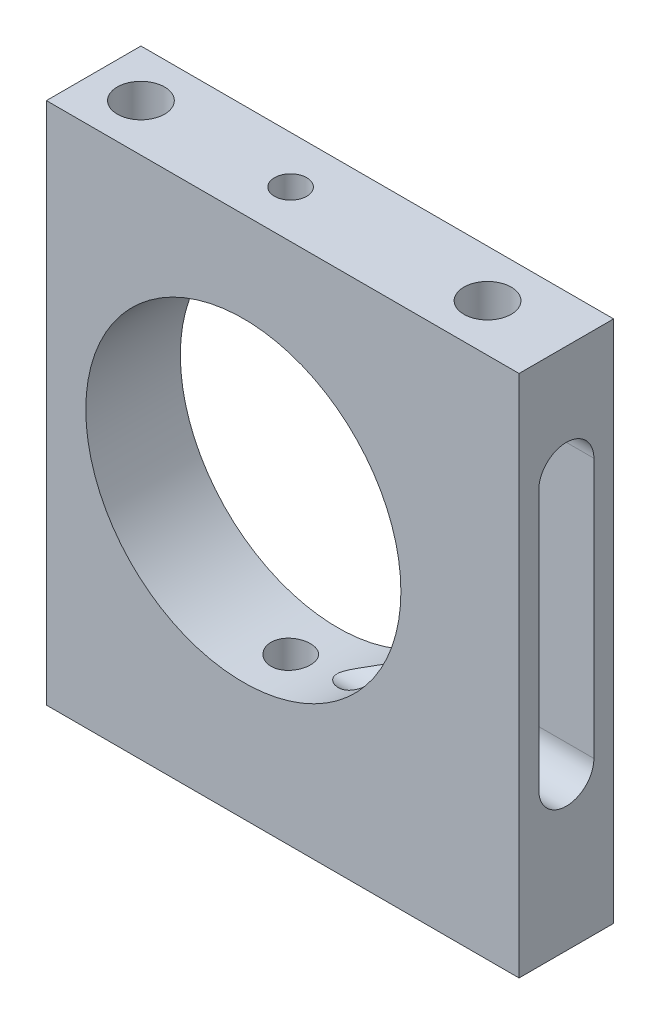
ISO-10303-21;
HEADER;
FILE_DESCRIPTION(('STEP AP214'),'2;1');
FILE_NAME('part.step','',(''),(''),'','','');
FILE_SCHEMA(('AUTOMOTIVE_DESIGN { 1 0 10303 214 1 1 1 1 }'));
ENDSEC;
DATA;
#1=APPLICATION_CONTEXT('core data for automotive mechanical design processes');
#2=APPLICATION_PROTOCOL_DEFINITION('international standard','automotive_design',2000,#1);
#3=PRODUCT_CONTEXT('',#1,'mechanical');
#4=PRODUCT('Part','Part','',(#3));
#5=PRODUCT_RELATED_PRODUCT_CATEGORY('part','',(#4));
#6=PRODUCT_DEFINITION_FORMATION('','',#4);
#7=PRODUCT_DEFINITION_CONTEXT('part definition',#1,'design');
#8=PRODUCT_DEFINITION('design','',#6,#7);
#9=PRODUCT_DEFINITION_SHAPE('','',#8);
#10=(LENGTH_UNIT() NAMED_UNIT(*) SI_UNIT(.MILLI.,.METRE.));
#11=(NAMED_UNIT(*) PLANE_ANGLE_UNIT() SI_UNIT($,.RADIAN.));
#12=(NAMED_UNIT(*) SI_UNIT($,.STERADIAN.) SOLID_ANGLE_UNIT());
#13=UNCERTAINTY_MEASURE_WITH_UNIT(LENGTH_MEASURE(1.E-05),#10,'distance_accuracy_value','');
#14=(GEOMETRIC_REPRESENTATION_CONTEXT(3) GLOBAL_UNCERTAINTY_ASSIGNED_CONTEXT((#13)) GLOBAL_UNIT_ASSIGNED_CONTEXT((#10,
#11,#12)) REPRESENTATION_CONTEXT('',''));
#15=CARTESIAN_POINT('',(0.,0.,0.));
#16=DIRECTION('',(0.,0.,1.));
#17=DIRECTION('',(1.,0.,0.));
#18=AXIS2_PLACEMENT_3D('',#15,#16,#17);
#19=CARTESIAN_POINT('',(-17.5,15.73,6.));
#20=DIRECTION('',(0.,-1.,0.));
#21=DIRECTION('',(0.,0.,-1.));
#22=AXIS2_PLACEMENT_3D('',#19,#20,#21);
#23=PLANE('',#22);
#24=CARTESIAN_POINT('',(0.,15.73,3.));
#25=DIRECTION('',(0.,1.,0.));
#26=DIRECTION('',(0.,0.,1.));
#27=AXIS2_PLACEMENT_3D('',#24,#25,#26);
#28=CIRCLE('',#27,1.025);
#29=CARTESIAN_POINT('',(0.,15.73,4.025));
#30=VERTEX_POINT('',#29);
#31=EDGE_CURVE('E245',#30,#30,#28,.T.);
#32=ORIENTED_EDGE('',*,*,#31,.F.);
#33=EDGE_LOOP('',(#32));
#34=FACE_BOUND('',#33,.T.);
#35=CARTESIAN_POINT('',(-9.50000000000001,15.73,3.));
#36=DIRECTION('',(0.,1.,0.));
#37=DIRECTION('',(0.,0.,1.));
#38=AXIS2_PLACEMENT_3D('',#35,#36,#37);
#39=CIRCLE('',#38,1.5);
#40=CARTESIAN_POINT('',(-9.50000000000001,15.73,4.5));
#41=VERTEX_POINT('',#40);
#42=EDGE_CURVE('E287',#41,#41,#39,.T.);
#43=ORIENTED_EDGE('',*,*,#42,.F.);
#44=EDGE_LOOP('',(#43));
#45=FACE_BOUND('',#44,.T.);
#46=DIRECTION('',(-1.,0.,0.));
#47=VECTOR('',#46,1.);
#48=CARTESIAN_POINT('',(-17.5,15.73,0.));
#49=LINE('',#48,#47);
#50=CARTESIAN_POINT('',(17.5,15.73,0.));
#51=VERTEX_POINT('',#50);
#52=CARTESIAN_POINT('',(-12.5,15.73,0.));
#53=VERTEX_POINT('',#52);
#54=EDGE_CURVE('E131',#51,#53,#49,.T.);
#55=ORIENTED_EDGE('',*,*,#54,.T.);
#56=DIRECTION('',(0.,0.,-1.));
#57=VECTOR('',#56,1.);
#58=CARTESIAN_POINT('',(-12.5,15.73,6.));
#59=LINE('',#58,#57);
#60=CARTESIAN_POINT('',(-12.5,15.73,6.));
#61=VERTEX_POINT('',#60);
#62=EDGE_CURVE('E118',#61,#53,#59,.T.);
#63=ORIENTED_EDGE('',*,*,#62,.F.);
#64=DIRECTION('',(-1.,0.,0.));
#65=VECTOR('',#64,1.);
#66=CARTESIAN_POINT('',(-17.5,15.73,6.));
#67=LINE('',#66,#65);
#68=CARTESIAN_POINT('',(17.5,15.73,6.));
#69=VERTEX_POINT('',#68);
#70=EDGE_CURVE('E129',#69,#61,#67,.T.);
#71=ORIENTED_EDGE('',*,*,#70,.F.);
#72=DIRECTION('',(0.,0.,-1.));
#73=VECTOR('',#72,1.);
#74=CARTESIAN_POINT('',(17.5,15.73,6.));
#75=LINE('',#74,#73);
#76=EDGE_CURVE('E154',#69,#51,#75,.T.);
#77=ORIENTED_EDGE('',*,*,#76,.T.);
#78=EDGE_LOOP('',(#55,#63,#71,#77));
#79=FACE_BOUND('',#78,.T.);
#80=CARTESIAN_POINT('',(12.5,15.73,3.));
#81=DIRECTION('',(0.,1.,0.));
#82=DIRECTION('',(0.,0.,1.));
#83=AXIS2_PLACEMENT_3D('',#80,#81,#82);
#84=CIRCLE('',#83,1.5);
#85=CARTESIAN_POINT('',(12.5,15.73,4.5));
#86=VERTEX_POINT('',#85);
#87=EDGE_CURVE('E295',#86,#86,#84,.T.);
#88=ORIENTED_EDGE('',*,*,#87,.F.);
#89=EDGE_LOOP('',(#88));
#90=FACE_BOUND('',#89,.T.);
#91=ADVANCED_FACE('F37',(#34,#45,#79,#90),#23,.F.);
#92=CARTESIAN_POINT('',(0.,0.,6.));
#93=DIRECTION('',(0.,0.,-1.));
#94=DIRECTION('',(-1.,0.,0.));
#95=AXIS2_PLACEMENT_3D('',#92,#93,#94);
#96=PLANE('',#95);
#97=ORIENTED_EDGE('',*,*,#70,.T.);
#98=DIRECTION('',(0.,1.,0.));
#99=VECTOR('',#98,1.);
#100=CARTESIAN_POINT('',(-12.5,15.73,6.));
#101=LINE('',#100,#99);
#102=CARTESIAN_POINT('',(-12.5,-17.5,6.));
#103=VERTEX_POINT('',#102);
#104=EDGE_CURVE('E115',#103,#61,#101,.T.);
#105=ORIENTED_EDGE('',*,*,#104,.F.);
#106=DIRECTION('',(1.,0.,0.));
#107=VECTOR('',#106,1.);
#108=CARTESIAN_POINT('',(-17.5,-17.5,6.));
#109=LINE('',#108,#107);
#110=CARTESIAN_POINT('',(17.5,-17.5,6.));
#111=VERTEX_POINT('',#110);
#112=EDGE_CURVE('E138',#103,#111,#109,.T.);
#113=ORIENTED_EDGE('',*,*,#112,.T.);
#114=DIRECTION('',(0.,1.,0.));
#115=VECTOR('',#114,1.);
#116=CARTESIAN_POINT('',(17.5,-17.5,6.));
#117=LINE('',#116,#115);
#118=EDGE_CURVE('E136',#111,#69,#117,.T.);
#119=ORIENTED_EDGE('',*,*,#118,.T.);
#120=EDGE_LOOP('',(#97,#105,#113,#119));
#121=FACE_BOUND('',#120,.T.);
#122=CARTESIAN_POINT('',(0.,0.,6.));
#123=DIRECTION('',(0.,0.,1.));
#124=DIRECTION('',(1.,0.,0.));
#125=AXIS2_PLACEMENT_3D('',#122,#123,#124);
#126=CIRCLE('',#125,10.);
#127=CARTESIAN_POINT('',(10.,0.,6.));
#128=VERTEX_POINT('',#127);
#129=EDGE_CURVE('E149',#128,#128,#126,.T.);
#130=ORIENTED_EDGE('',*,*,#129,.F.);
#131=EDGE_LOOP('',(#130));
#132=FACE_BOUND('',#131,.T.);
#133=ADVANCED_FACE('F133',(#121,#132),#96,.F.);
#134=CARTESIAN_POINT('',(0.,0.,0.));
#135=DIRECTION('',(0.,0.,-1.));
#136=DIRECTION('',(-1.,0.,0.));
#137=AXIS2_PLACEMENT_3D('',#134,#135,#136);
#138=PLANE('',#137);
#139=DIRECTION('',(0.,-1.,0.));
#140=VECTOR('',#139,1.);
#141=CARTESIAN_POINT('',(-12.5,15.73,0.));
#142=LINE('',#141,#140);
#143=CARTESIAN_POINT('',(-12.5,-17.5,0.));
#144=VERTEX_POINT('',#143);
#145=EDGE_CURVE('E58',#53,#144,#142,.T.);
#146=ORIENTED_EDGE('',*,*,#145,.F.);
#147=ORIENTED_EDGE('',*,*,#54,.F.);
#148=DIRECTION('',(0.,1.,0.));
#149=VECTOR('',#148,1.);
#150=CARTESIAN_POINT('',(17.5,-17.5,0.));
#151=LINE('',#150,#149);
#152=CARTESIAN_POINT('',(17.5,-17.5,0.));
#153=VERTEX_POINT('',#152);
#154=EDGE_CURVE('E146',#153,#51,#151,.T.);
#155=ORIENTED_EDGE('',*,*,#154,.F.);
#156=DIRECTION('',(1.,0.,0.));
#157=VECTOR('',#156,1.);
#158=CARTESIAN_POINT('',(-17.5,-17.5,0.));
#159=LINE('',#158,#157);
#160=EDGE_CURVE('E142',#144,#153,#159,.T.);
#161=ORIENTED_EDGE('',*,*,#160,.F.);
#162=EDGE_LOOP('',(#146,#147,#155,#161));
#163=FACE_BOUND('',#162,.T.);
#164=CARTESIAN_POINT('',(0.,0.,0.));
#165=DIRECTION('',(0.,0.,1.));
#166=DIRECTION('',(1.,0.,0.));
#167=AXIS2_PLACEMENT_3D('',#164,#165,#166);
#168=CIRCLE('',#167,10.);
#169=CARTESIAN_POINT('',(10.,0.,0.));
#170=VERTEX_POINT('',#169);
#171=EDGE_CURVE('E215',#170,#170,#168,.T.);
#172=ORIENTED_EDGE('',*,*,#171,.T.);
#173=EDGE_LOOP('',(#172));
#174=FACE_BOUND('',#173,.T.);
#175=ADVANCED_FACE('F236',(#163,#174),#138,.T.);
#176=CARTESIAN_POINT('',(17.5,-17.5,6.));
#177=DIRECTION('',(-1.,0.,0.));
#178=DIRECTION('',(0.,0.,1.));
#179=AXIS2_PLACEMENT_3D('',#176,#177,#178);
#180=PLANE('',#179);
#181=DIRECTION('',(0.,-1.,0.));
#182=VECTOR('',#181,1.);
#183=CARTESIAN_POINT('',(17.5,-7.80607126836217,4.75));
#184=LINE('',#183,#182);
#185=CARTESIAN_POINT('',(17.5,8.69392873163782,4.75));
#186=VERTEX_POINT('',#185);
#187=CARTESIAN_POINT('',(17.5,-7.80607126836217,4.75));
#188=VERTEX_POINT('',#187);
#189=EDGE_CURVE('E225',#186,#188,#184,.T.);
#190=ORIENTED_EDGE('',*,*,#189,.F.);
#191=CARTESIAN_POINT('',(17.5,8.69392873163783,3.));
#192=DIRECTION('',(1.,0.,0.));
#193=DIRECTION('',(0.,0.,-1.));
#194=AXIS2_PLACEMENT_3D('',#191,#192,#193);
#195=CIRCLE('',#194,1.75);
#196=CARTESIAN_POINT('',(17.5,8.69392873163783,1.25));
#197=VERTEX_POINT('',#196);
#198=EDGE_CURVE('E66',#197,#186,#195,.T.);
#199=ORIENTED_EDGE('',*,*,#198,.F.);
#200=DIRECTION('',(0.,1.,0.));
#201=VECTOR('',#200,1.);
#202=CARTESIAN_POINT('',(17.5,-7.80607126836217,1.25));
#203=LINE('',#202,#201);
#204=CARTESIAN_POINT('',(17.5,-7.80607126836217,1.25));
#205=VERTEX_POINT('',#204);
#206=EDGE_CURVE('E214',#205,#197,#203,.T.);
#207=ORIENTED_EDGE('',*,*,#206,.F.);
#208=CARTESIAN_POINT('',(17.5,-7.80607126836217,3.));
#209=DIRECTION('',(1.,0.,0.));
#210=DIRECTION('',(0.,0.,-1.));
#211=AXIS2_PLACEMENT_3D('',#208,#209,#210);
#212=CIRCLE('',#211,1.75);
#213=EDGE_CURVE('E301',#188,#205,#212,.T.);
#214=ORIENTED_EDGE('',*,*,#213,.F.);
#215=EDGE_LOOP('',(#190,#199,#207,#214));
#216=FACE_BOUND('',#215,.T.);
#217=ORIENTED_EDGE('',*,*,#154,.T.);
#218=ORIENTED_EDGE('',*,*,#76,.F.);
#219=ORIENTED_EDGE('',*,*,#118,.F.);
#220=DIRECTION('',(0.,0.,-1.));
#221=VECTOR('',#220,1.);
#222=CARTESIAN_POINT('',(17.5,-17.5,6.));
#223=LINE('',#222,#221);
#224=EDGE_CURVE('E140',#111,#153,#223,.T.);
#225=ORIENTED_EDGE('',*,*,#224,.T.);
#226=EDGE_LOOP('',(#217,#218,#219,#225));
#227=FACE_BOUND('',#226,.T.);
#228=ADVANCED_FACE('F39',(#216,#227),#180,.F.);
#229=CARTESIAN_POINT('',(-17.5,-17.5,6.));
#230=DIRECTION('',(0.,1.,0.));
#231=DIRECTION('',(0.,0.,1.));
#232=AXIS2_PLACEMENT_3D('',#229,#230,#231);
#233=PLANE('',#232);
#234=CARTESIAN_POINT('',(0.,-17.5,2.99043755803367));
#235=DIRECTION('',(0.,-1.,0.));
#236=DIRECTION('',(0.,0.,-1.));
#237=AXIS2_PLACEMENT_3D('',#234,#235,#236);
#238=CIRCLE('',#237,1.24999999999999);
#239=CARTESIAN_POINT('',(0.,-17.5,1.74043755803368));
#240=VERTEX_POINT('',#239);
#241=EDGE_CURVE('E272',#240,#240,#238,.T.);
#242=ORIENTED_EDGE('',*,*,#241,.F.);
#243=EDGE_LOOP('',(#242));
#244=FACE_BOUND('',#243,.T.);
#245=ORIENTED_EDGE('',*,*,#112,.F.);
#246=DIRECTION('',(0.,0.,1.));
#247=VECTOR('',#246,1.);
#248=CARTESIAN_POINT('',(-12.5,-17.5,6.));
#249=LINE('',#248,#247);
#250=EDGE_CURVE('E119',#144,#103,#249,.T.);
#251=ORIENTED_EDGE('',*,*,#250,.F.);
#252=ORIENTED_EDGE('',*,*,#160,.T.);
#253=ORIENTED_EDGE('',*,*,#224,.F.);
#254=EDGE_LOOP('',(#245,#251,#252,#253));
#255=FACE_BOUND('',#254,.T.);
#256=ADVANCED_FACE('F240',(#244,#255),#233,.F.);
#257=CARTESIAN_POINT('',(0.,0.,6.));
#258=DIRECTION('',(0.,0.,-1.));
#259=DIRECTION('',(-1.,0.,0.));
#260=AXIS2_PLACEMENT_3D('',#257,#258,#259);
#261=CYLINDRICAL_SURFACE('',#260,10.);
#262=CARTESIAN_POINT('',(0.,-10.,1.74043755803367));
#263=CARTESIAN_POINT('',(-0.0699205477778802,-9.99999902448214,1.74044052850153));
#264=CARTESIAN_POINT('',(-0.139884787151373,-9.99925892277451,1.74632399761832));
#265=CARTESIAN_POINT('',(-0.277866401044875,-9.9963777005568,1.76970143531907));
#266=CARTESIAN_POINT('',(-0.34588166531187,-9.99423511720715,1.78720752699537));
#267=CARTESIAN_POINT('',(-0.477947787406524,-9.98879030522203,1.83330637999072));
#268=CARTESIAN_POINT('',(-0.542001280073065,-9.98548885727771,1.8618916789386));
#269=CARTESIAN_POINT('',(-0.664389737446514,-9.97809350439049,1.92932120001857));
#270=CARTESIAN_POINT('',(-0.722725680778181,-9.97399973542058,1.96816366229903));
#271=CARTESIAN_POINT('',(-0.832356408465653,-9.96545160653163,2.05523353295347));
#272=CARTESIAN_POINT('',(-0.883615182468557,-9.96099557346209,2.10350612270679));
#273=CARTESIAN_POINT('',(-0.97732639677874,-9.95223863004875,2.20796896980199));
#274=CARTESIAN_POINT('',(-1.01977838819612,-9.94793772762134,2.2641596304903));
#275=CARTESIAN_POINT('',(-1.09480508064196,-9.93996152809793,2.3830975468165));
#276=CARTESIAN_POINT('',(-1.12734604797053,-9.93628838588956,2.44586623881764));
#277=CARTESIAN_POINT('',(-1.18141153828755,-9.93000564228841,2.57603108400735));
#278=CARTESIAN_POINT('',(-1.2029364790326,-9.92739600056568,2.64342706160718));
#279=CARTESIAN_POINT('',(-1.23424949001237,-9.92355169801807,2.78055965582705));
#280=CARTESIAN_POINT('',(-1.24409835736584,-9.92230991718372,2.85028218688576));
#281=CARTESIAN_POINT('',(-1.25196777477861,-9.92132014071396,2.99040068976958));
#282=CARTESIAN_POINT('',(-1.2499888005012,-9.92157208500754,3.06079663439931));
#283=CARTESIAN_POINT('',(-1.23430861822394,-9.92353477684876,3.19983997165806));
#284=CARTESIAN_POINT('',(-1.22067438149234,-9.92523718980165,3.2684950511338));
#285=CARTESIAN_POINT('',(-1.18217519159102,-9.92989599878815,3.40253506864316));
#286=CARTESIAN_POINT('',(-1.15731001087594,-9.93285242022862,3.46791994039068));
#287=CARTESIAN_POINT('',(-1.09698277995582,-9.93969557932326,3.59377155754451));
#288=CARTESIAN_POINT('',(-1.06149162685381,-9.94358486605722,3.65422420815815));
#289=CARTESIAN_POINT('',(-0.980940734728453,-9.95185355715299,3.76834090524029));
#290=CARTESIAN_POINT('',(-0.935880558040382,-9.95623298392831,3.8220046410205));
#291=CARTESIAN_POINT('',(-0.837099555376884,-9.96502554945213,3.92140891339503));
#292=CARTESIAN_POINT('',(-0.783321003920001,-9.96943871193445,3.96709210391665));
#293=CARTESIAN_POINT('',(-0.668828584556957,-9.97777316277926,4.04879199804893));
#294=CARTESIAN_POINT('',(-0.608114700659122,-9.98169445000753,4.08480867936966));
#295=CARTESIAN_POINT('',(-0.481430835681737,-9.9886057610929,4.14615321826562));
#296=CARTESIAN_POINT('',(-0.415459097668855,-9.99159547200768,4.17147748497427));
#297=CARTESIAN_POINT('',(-0.280153970215526,-9.99630392890031,4.21067280479528));
#298=CARTESIAN_POINT('',(-0.210820738315332,-9.99802273437935,4.22454439410218));
#299=CARTESIAN_POINT('',(-0.0712565819567479,-9.9999879820538,4.24036627016393));
#300=CARTESIAN_POINT('',(-0.00103474509930317,-10.0002441807132,4.24239555421569));
#301=CARTESIAN_POINT('',(0.138748018248748,-9.99928169002715,4.23468369100568));
#302=CARTESIAN_POINT('',(0.208308958782352,-9.99806303209106,4.22494279440786));
#303=CARTESIAN_POINT('',(0.344562253860759,-9.99429384378346,4.19403270364647));
#304=CARTESIAN_POINT('',(0.41126328521235,-9.99174770406934,4.17290117633234));
#305=CARTESIAN_POINT('',(0.5401748274292,-9.98560861550098,4.1198488320772));
#306=CARTESIAN_POINT('',(0.602385185732653,-9.98201563110312,4.08792764878794));
#307=CARTESIAN_POINT('',(0.720902260343709,-9.97415911455056,4.01401098927993));
#308=CARTESIAN_POINT('',(0.777176879971904,-9.96989222021254,3.97196441313084));
#309=CARTESIAN_POINT('',(0.881898494813153,-9.96117571162828,3.87906280926656));
#310=CARTESIAN_POINT('',(0.930345179168423,-9.95672609013449,3.82820743190817));
#311=CARTESIAN_POINT('',(1.018315979409,-9.94811552731292,3.71878384965509));
#312=CARTESIAN_POINT('',(1.05778773028396,-9.94395637360664,3.66017338487846));
#313=CARTESIAN_POINT('',(1.12632644472175,-9.93642705518574,3.53710843560631));
#314=CARTESIAN_POINT('',(1.15539361686418,-9.93305687465513,3.4726540682954));
#315=CARTESIAN_POINT('',(1.20221328943326,-9.92749925196497,3.33989989845986));
#316=CARTESIAN_POINT('',(1.21999531372855,-9.92530872592394,3.27161064300968));
#317=CARTESIAN_POINT('',(1.24383499693391,-9.92234957953727,3.13298631614333));
#318=CARTESIAN_POINT('',(1.24989320126787,-9.92158089304388,3.06265134005416));
#319=CARTESIAN_POINT('',(1.25010326804241,-9.92155438491228,2.92245309343133));
#320=CARTESIAN_POINT('',(1.24433739884963,-9.92228612375977,2.85258993386772));
#321=CARTESIAN_POINT('',(1.22123720242465,-9.92515557268601,2.71483399336113));
#322=CARTESIAN_POINT('',(1.20390287395288,-9.92729328291541,2.64694121262927));
#323=CARTESIAN_POINT('',(1.15818353684482,-9.93273057887275,2.51506407965047));
#324=CARTESIAN_POINT('',(1.12980249048546,-9.93602974796392,2.45107833552276));
#325=CARTESIAN_POINT('',(1.06280345107515,-9.94341891622409,2.32876423100951));
#326=CARTESIAN_POINT('',(1.02418532975479,-9.94750892530207,2.27043594152376));
#327=CARTESIAN_POINT('',(0.937503165632912,-9.95605302376117,2.16067194536343));
#328=CARTESIAN_POINT('',(0.889377812887472,-9.96050936042016,2.10928482755618));
#329=CARTESIAN_POINT('',(0.785175113484185,-9.9692641579645,2.01528414544969));
#330=CARTESIAN_POINT('',(0.729095894570778,-9.97356258137795,1.97267265264652));
#331=CARTESIAN_POINT('',(0.610332810427101,-9.98153528293373,1.89729487948103));
#332=CARTESIAN_POINT('',(0.547624639798081,-9.9852071253915,1.86456665508405));
#333=CARTESIAN_POINT('',(0.417591451150637,-9.99148824538362,1.81015193657553));
#334=CARTESIAN_POINT('',(0.350271540435115,-9.99409867684788,1.78845344485695));
#335=CARTESIAN_POINT('',(0.235502885983961,-9.99733360163873,1.76190788894802));
#336=CARTESIAN_POINT('',(0.188777831758459,-9.99832862947727,1.75386808704264));
#337=CARTESIAN_POINT('',(0.0947085316062169,-9.99966215664594,1.74313193518706));
#338=CARTESIAN_POINT('',(0.0473642902480134,-10.0000006608173,1.74043554583402));
#339=CARTESIAN_POINT('',(0.,-10.,1.74043755803367));
#340=B_SPLINE_CURVE_WITH_KNOTS('',3,(#262,#263,#264,#265,#266,#267,#268,#269,#270,#271,#272,
#273,#274,#275,#276,#277,#278,#279,#280,#281,#282,#283,#284,#285,#286,#287,#288,#289,#290,#291,
#292,#293,#294,#295,#296,#297,#298,#299,#300,#301,#302,#303,#304,#305,#306,#307,#308,#309,#310,
#311,#312,#313,#314,#315,#316,#317,#318,#319,#320,#321,#322,#323,#324,#325,#326,#327,#328,#329,
#330,#331,#332,#333,#334,#335,#336,#337,#338,#339),.UNSPECIFIED.,.T.,.F.,(4,2,2,2,2,2,2,2,2,2,2,
2,2,2,2,2,2,2,2,2,2,2,2,2,2,2,2,2,2,2,2,2,2,2,2,2,2,2,4),(0.,0.209588636388122,
0.419396230471711,0.629062754090881,0.838693327955361,1.04935406600921,1.26002553900004,
1.47140625159434,1.68277894748402,1.89304612643159,2.10330484942331,2.31236348220845,
2.52142635083119,2.73106713142765,2.94071750256817,3.15181739068206,3.36291776556555,
3.574088978658,3.78525030451888,3.99500139695958,4.20474802250961,4.41380526946695,
4.62286961539471,4.83301201464208,5.04316275687541,5.25450985753783,5.46585272110766,
5.67664037140459,5.88741821505308,6.09673450601103,6.3060508193977,6.51529212353239,
6.72453604956127,6.9351761884591,7.14586599235002,7.35735701518422,7.56861749342012,
7.71059421593809,7.85256989150213),.UNSPECIFIED.);
#341=CARTESIAN_POINT('',(0.,-10.,1.74043755803367));
#342=VERTEX_POINT('',#341);
#343=EDGE_CURVE('E248',#342,#342,#340,.T.);
#344=ORIENTED_EDGE('',*,*,#343,.F.);
#345=EDGE_LOOP('',(#344));
#346=FACE_BOUND('',#345,.T.);
#347=CARTESIAN_POINT('',(0.,0.,1.25));
#348=DIRECTION('',(0.,0.,-1.));
#349=DIRECTION('',(-1.,0.,0.));
#350=AXIS2_PLACEMENT_3D('',#347,#348,#349);
#351=CIRCLE('',#350,10.);
#352=CARTESIAN_POINT('',(4.94121475036273,8.69392873163783,1.25));
#353=VERTEX_POINT('',#352);
#354=CARTESIAN_POINT('',(6.25022010438437,-7.80607126836217,1.25));
#355=VERTEX_POINT('',#354);
#356=EDGE_CURVE('E11',#353,#355,#351,.T.);
#357=ORIENTED_EDGE('',*,*,#356,.F.);
#358=CARTESIAN_POINT('',(1.5,9.88685996664259,1.71960355024313));
#359=CARTESIAN_POINT('',(1.62678484319834,9.86762147965955,1.70167817872958));
#360=CARTESIAN_POINT('',(1.75297182773525,9.84598520811179,1.68233038165694));
#361=CARTESIAN_POINT('',(2.00413258758102,9.79794938784062,1.64183031381875));
#362=CARTESIAN_POINT('',(2.12910648791814,9.77155033561305,1.6206782312619));
#363=CARTESIAN_POINT('',(2.50288736164746,9.68509672069805,1.5559543331762));
#364=CARTESIAN_POINT('',(2.74987500619326,9.61788890037698,1.51122188761716));
#365=CARTESIAN_POINT('',(3.23395244948236,9.46597425461652,1.42714999444565));
#366=CARTESIAN_POINT('',(3.47114128376889,9.38163061673334,1.38772304729189));
#367=CARTESIAN_POINT('',(3.93961286108836,9.19471788258353,1.3202427755575));
#368=CARTESIAN_POINT('',(4.17090538642248,9.09218157162545,1.29216928430742));
#369=CARTESIAN_POINT('',(4.49010504731822,8.93584713043343,1.26620802368704));
#370=CARTESIAN_POINT('',(4.58107699657468,8.88955350122936,1.26030758558731));
#371=CARTESIAN_POINT('',(4.76202390170395,8.79395479817185,1.25220183100777));
#372=CARTESIAN_POINT('',(4.85199385534668,8.74463910747046,1.250010419035));
#373=CARTESIAN_POINT('',(4.94121475036273,8.69392873163783,1.25));
#374=B_SPLINE_CURVE_WITH_KNOTS('',3,(#358,#359,#360,#361,#362,#363,#364,#365,#366,#367,#368,
#369,#370,#371,#372,#373),.UNSPECIFIED.,.F.,.F.,(4,2,2,2,2,2,2,4),(0.,0.388364504128269,
0.776688546584948,1.5554148071096,2.31909527705496,3.0814132316405,3.38804524828725,
3.69582425065891),.UNSPECIFIED.);
#375=CARTESIAN_POINT('',(1.5,9.88685996664259,1.71960355024313));
#376=VERTEX_POINT('',#375);
#377=EDGE_CURVE('E167',#376,#353,#374,.T.);
#378=ORIENTED_EDGE('',*,*,#377,.F.);
#379=DIRECTION('',(0.,0.,-1.));
#380=VECTOR('',#379,1.);
#381=CARTESIAN_POINT('',(1.5,9.88685996664259,6.));
#382=LINE('',#381,#380);
#383=CARTESIAN_POINT('',(1.5,9.88685996664259,4.28039644975687));
#384=VERTEX_POINT('',#383);
#385=EDGE_CURVE('E156',#376,#384,#382,.F.);
#386=ORIENTED_EDGE('',*,*,#385,.T.);
#387=CARTESIAN_POINT('',(4.94121475036273,8.69392873163783,4.75));
#388=CARTESIAN_POINT('',(4.84795414563938,8.74693713477971,4.74998455156969));
#389=CARTESIAN_POINT('',(4.75386477447625,8.79842428354274,4.74759253349119));
#390=CARTESIAN_POINT('',(4.56427408514109,8.89825021233744,4.73875685066839));
#391=CARTESIAN_POINT('',(4.46877351302925,8.94659058771355,4.73231525690398));
#392=CARTESIAN_POINT('',(4.27669755405592,9.0399803984156,4.71609628216258));
#393=CARTESIAN_POINT('',(4.18012462326748,9.08503606092137,4.7063254235979));
#394=CARTESIAN_POINT('',(3.98584706188703,9.17193264797203,4.68405001921048));
#395=CARTESIAN_POINT('',(3.88814227833723,9.21377313204778,4.67154509972928));
#396=CARTESIAN_POINT('',(3.59594967549828,9.33343887173836,4.63112249619262));
#397=CARTESIAN_POINT('',(3.3999625897544,9.40658265604778,4.60006328466174));
#398=CARTESIAN_POINT('',(3.00446678915577,9.54027155102811,4.53354951089016));
#399=CARTESIAN_POINT('',(2.80495712408596,9.60081320416141,4.4980937466518));
#400=CARTESIAN_POINT('',(2.4229728645251,9.70382845745798,4.43038425437373));
#401=CARTESIAN_POINT('',(2.24081734643674,9.74751045090911,4.39816955737462));
#402=CARTESIAN_POINT('',(1.87288115826769,9.82485488494603,4.33641005971918));
#403=CARTESIAN_POINT('',(1.68708608315648,9.85846104595979,4.30688087497533));
#404=CARTESIAN_POINT('',(1.5,9.88685996664259,4.28039644975687));
#405=B_SPLINE_CURVE_WITH_KNOTS('',3,(#387,#388,#389,#390,#391,#392,#393,#394,#395,#396,#397,
#398,#399,#400,#401,#402,#403,#404),.UNSPECIFIED.,.F.,.F.,(4,2,2,2,2,2,2,2,4),(0.,
0.321733092031999,0.643301781324079,0.964244068695702,1.28523024603424,1.91912172321635,
2.55318688715013,3.12309119495975,3.69612186986691),.UNSPECIFIED.);
#406=CARTESIAN_POINT('',(4.94121475036273,8.69392873163783,4.75));
#407=VERTEX_POINT('',#406);
#408=EDGE_CURVE('E159',#407,#384,#405,.T.);
#409=ORIENTED_EDGE('',*,*,#408,.F.);
#410=CARTESIAN_POINT('',(0.,0.,4.75));
#411=DIRECTION('',(0.,0.,1.));
#412=DIRECTION('',(1.,0.,0.));
#413=AXIS2_PLACEMENT_3D('',#410,#411,#412);
#414=CIRCLE('',#413,10.);
#415=CARTESIAN_POINT('',(6.25022010438437,-7.80607126836217,4.75));
#416=VERTEX_POINT('',#415);
#417=EDGE_CURVE('E200',#416,#407,#414,.T.);
#418=ORIENTED_EDGE('',*,*,#417,.F.);
#419=CARTESIAN_POINT('',(6.25022010438437,-7.80607126836217,1.25));
#420=CARTESIAN_POINT('',(6.19974730155435,-7.84648527839715,1.25000329163173));
#421=CARTESIAN_POINT('',(6.14889265819168,-7.88639930964745,1.25139954547737));
#422=CARTESIAN_POINT('',(6.04651874967251,-7.96516025383751,1.25679870092751));
#423=CARTESIAN_POINT('',(5.99499965373027,-8.00400743088069,1.26080095123477));
#424=CARTESIAN_POINT('',(5.83968636885976,-8.11878162569189,1.27643591177992));
#425=CARTESIAN_POINT('',(5.73500884842715,-8.19304319983211,1.29169774697626));
#426=CARTESIAN_POINT('',(5.52342117862188,-8.33716411743348,1.33085391969007));
#427=CARTESIAN_POINT('',(5.41650184291782,-8.40699664534698,1.35479585245096));
#428=CARTESIAN_POINT('',(5.2015231552491,-8.54167720068667,1.41044232334594));
#429=CARTESIAN_POINT('',(5.09346351697227,-8.60652394067981,1.44214885767328));
#430=CARTESIAN_POINT('',(4.86964666712301,-8.73523209697328,1.51507941199436));
#431=CARTESIAN_POINT('',(4.75385041844396,-8.7987484943324,1.55679207965006));
#432=CARTESIAN_POINT('',(4.52228360945924,-8.91997994494455,1.64815946868587));
#433=CARTESIAN_POINT('',(4.40651308811286,-8.97769220108554,1.6978179897198));
#434=CARTESIAN_POINT('',(4.17613617704423,-9.08713914895632,1.80532047143089));
#435=CARTESIAN_POINT('',(4.0615283705865,-9.13888219234013,1.86315273746203));
#436=CARTESIAN_POINT('',(3.89167897417167,-9.21187477032555,1.9570344714774));
#437=CARTESIAN_POINT('',(3.8354339965674,-9.23542461476908,1.98949915481156));
#438=CARTESIAN_POINT('',(3.72396169790257,-9.28093401038914,2.05716295468314));
#439=CARTESIAN_POINT('',(3.66873430242092,-9.30289367821054,2.09236187026194));
#440=CARTESIAN_POINT('',(3.54041534081774,-9.35263023568732,2.1790351557746));
#441=CARTESIAN_POINT('',(3.46793192252878,-9.37970939900591,2.23185549118317));
#442=CARTESIAN_POINT('',(3.36315187397991,-9.41756851426451,2.31697154889374));
#443=CARTESIAN_POINT('',(3.32892497140079,-9.42971416825286,2.3462822614399));
#444=CARTESIAN_POINT('',(3.26230830315127,-9.45296688968568,2.40729173379753));
#445=CARTESIAN_POINT('',(3.22991733039741,-9.46407464271779,2.43898889188656));
#446=CARTESIAN_POINT('',(3.16911546581821,-9.48460291583022,2.50387524927822));
#447=CARTESIAN_POINT('',(3.14059356464244,-9.49407530000431,2.53694253566027));
#448=CARTESIAN_POINT('',(3.08715075353287,-9.51158703326358,2.60630580811612));
#449=CARTESIAN_POINT('',(3.06222987764996,-9.51962636879818,2.64260182471518));
#450=CARTESIAN_POINT('',(3.02201713260117,-9.53245897047603,2.71176215381219));
#451=CARTESIAN_POINT('',(3.00579663855243,-9.53757773165426,2.74401467362302));
#452=CARTESIAN_POINT('',(2.97849124475206,-9.54614042067624,2.81083054331492));
#453=CARTESIAN_POINT('',(2.96739390400949,-9.54958840682803,2.84538805947599));
#454=CARTESIAN_POINT('',(2.95321587910776,-9.55398145639218,2.90971074643884));
#455=CARTESIAN_POINT('',(2.94904627226891,-9.5552670498543,2.93920835303535));
#456=CARTESIAN_POINT('',(2.94562816445527,-9.55632140543414,2.99851593407213));
#457=CARTESIAN_POINT('',(2.94637768431392,-9.55609077758986,3.02832577806728));
#458=CARTESIAN_POINT('',(2.9526909611292,-9.55414179880497,3.08728595052224));
#459=CARTESIAN_POINT('',(2.95824243207261,-9.55242724455202,3.11643776741739));
#460=CARTESIAN_POINT('',(2.97351284417836,-9.5476847798838,3.1735085346609));
#461=CARTESIAN_POINT('',(2.98323587393008,-9.54465558093751,3.20142624576097));
#462=CARTESIAN_POINT('',(3.01290063788283,-9.53534426851349,3.27211497596681));
#463=CARTESIAN_POINT('',(3.03546620244228,-9.52820280132085,3.31365839868506));
#464=CARTESIAN_POINT('',(3.08615341650686,-9.5119067906093,3.39277060503549));
#465=CARTESIAN_POINT('',(3.114294083865,-9.50274534408767,3.43032508859561));
#466=CARTESIAN_POINT('',(3.18188563603131,-9.48035729747217,3.51133390035644));
#467=CARTESIAN_POINT('',(3.22237527876793,-9.46669298495648,3.55378518988857));
#468=CARTESIAN_POINT('',(3.30676086294142,-9.43754943014802,3.63452385337636));
#469=CARTESIAN_POINT('',(3.35066309395153,-9.42206680845271,3.67280321080709));
#470=CARTESIAN_POINT('',(3.44082512343594,-9.38951706549109,3.74620177511564));
#471=CARTESIAN_POINT('',(3.48709512162239,-9.3724427732443,3.78130512246927));
#472=CARTESIAN_POINT('',(3.58109676911892,-9.33693090434049,3.84877440431763));
#473=CARTESIAN_POINT('',(3.62882905772452,-9.31849272627887,3.88113911756469));
#474=CARTESIAN_POINT('',(3.78051481494437,-9.25851216740793,3.97933877507312));
#475=CARTESIAN_POINT('',(3.88624478800935,-9.21469505818773,4.04105200409512));
#476=CARTESIAN_POINT('',(4.09981619488194,-9.12168490326266,4.1563397219169));
#477=CARTESIAN_POINT('',(4.20765967373051,-9.07248641591828,4.20990583909886));
#478=CARTESIAN_POINT('',(4.42389883117083,-8.96902676643839,4.30964934322107));
#479=CARTESIAN_POINT('',(4.53229215642676,-8.91477998809383,4.35584676292132));
#480=CARTESIAN_POINT('',(4.74910389736214,-8.80119267192419,4.4412765486218));
#481=CARTESIAN_POINT('',(4.85752229648822,-8.7418536252279,4.48051094329526));
#482=CARTESIAN_POINT('',(5.07534686194601,-8.61723947538745,4.55233667871105));
#483=CARTESIAN_POINT('',(5.18474552562517,-8.55189272848058,4.58482701968133));
#484=CARTESIAN_POINT('',(5.40239925768949,-8.41608786252538,4.64189006909439));
#485=CARTESIAN_POINT('',(5.51065461261042,-8.34563106074136,4.66646480918711));
#486=CARTESIAN_POINT('',(5.72553347336587,-8.19970294279948,4.70683530886271));
#487=CARTESIAN_POINT('',(5.83215623276373,-8.12422941249737,4.72262716290887));
#488=CARTESIAN_POINT('',(5.99033607376443,-8.00750775227491,4.73881209508142));
#489=CARTESIAN_POINT('',(6.04280386785953,-7.9679884482023,4.74295684718322));
#490=CARTESIAN_POINT('',(6.14705309482698,-7.88784288387215,4.74854938509575));
#491=CARTESIAN_POINT('',(6.19883434581911,-7.84721633866099,4.7499964698709));
#492=CARTESIAN_POINT('',(6.25022010438437,-7.80607126836217,4.75));
#493=B_SPLINE_CURVE_WITH_KNOTS('',3,(#419,#420,#421,#422,#423,#424,#425,#426,#427,#428,#429,
#430,#431,#432,#433,#434,#435,#436,#437,#438,#439,#440,#441,#442,#443,#444,#445,#446,#447,#448,
#449,#450,#451,#452,#453,#454,#455,#456,#457,#458,#459,#460,#461,#462,#463,#464,#465,#466,#467,
#468,#469,#470,#471,#472,#473,#474,#475,#476,#477,#478,#479,#480,#481,#482,#483,#484,#485,#486,
#487,#488,#489,#490,#491,#492),.UNSPECIFIED.,.F.,.F.,(4,2,2,2,2,2,2,2,2,2,2,2,2,2,2,2,2,2,2,2,2,
2,2,2,2,2,2,2,2,2,2,2,2,2,2,2,4),(0.,0.193934794747958,0.387821139414022,0.77510623861574,
1.16454786149362,1.55408971081137,1.96923973490325,2.3845888775256,2.79934966150876,
3.00652177743588,3.21367868115803,3.49427811372576,3.63421167729486,3.77405214416248,
3.90790779039,4.04176470225851,4.15079891200888,4.25956693357082,4.34860798378081,
4.4376132113188,4.52639138621073,4.61525677303139,4.75786349107348,4.90096531716643,
5.08125592113505,5.26188706939593,5.4433754533901,5.62494434718249,6.01447295856922,
6.40439916704461,6.79324654530447,7.18198044645784,7.57617203848132,7.97026237493756,
8.36452781399562,8.56191754515457,8.75935856430782),.UNSPECIFIED.);
#494=EDGE_CURVE('E51',#355,#416,#493,.T.);
#495=ORIENTED_EDGE('',*,*,#494,.F.);
#496=EDGE_LOOP('',(#357,#378,#386,#409,#418,#495));
#497=FACE_BOUND('',#496,.T.);
#498=ORIENTED_EDGE('',*,*,#129,.T.);
#499=EDGE_LOOP('',(#498));
#500=FACE_BOUND('',#499,.T.);
#501=ORIENTED_EDGE('',*,*,#171,.F.);
#502=EDGE_LOOP('',(#501));
#503=FACE_BOUND('',#502,.T.);
#504=CARTESIAN_POINT('',(0.,10.,4.025));
#505=CARTESIAN_POINT('',(-0.0574131062054997,9.99999932441296,4.02499751761973));
#506=CARTESIAN_POINT('',(-0.114863983907446,9.99950030929872,4.02015995492009));
#507=CARTESIAN_POINT('',(-0.228172445244313,9.99755762501468,4.00093529759261));
#508=CARTESIAN_POINT('',(-0.284028211643131,9.99611292001963,3.9865377315317));
#509=CARTESIAN_POINT('',(-0.392489265277672,9.99244190777641,3.94861707007687));
#510=CARTESIAN_POINT('',(-0.445096513369506,9.99021607755955,3.9250995433027));
#511=CARTESIAN_POINT('',(-0.545605673014005,9.9852315814176,3.8696174755506));
#512=CARTESIAN_POINT('',(-0.593508506046442,9.98247302015676,3.83765459335586));
#513=CARTESIAN_POINT('',(-0.683441035563872,9.97672034817429,3.76605981509955));
#514=CARTESIAN_POINT('',(-0.7254504931852,9.97372547839951,3.72640255493343));
#515=CARTESIAN_POINT('',(-0.802229792549905,9.96784399214136,3.64059888785723));
#516=CARTESIAN_POINT('',(-0.836999296519217,9.96495738071386,3.59445217835544));
#517=CARTESIAN_POINT('',(-0.898383757314619,9.95961151493231,3.49685239516759));
#518=CARTESIAN_POINT('',(-0.924980336165683,9.95715322902171,3.4453877052328));
#519=CARTESIAN_POINT('',(-0.969146617542708,9.95295182060713,3.33869333856713));
#520=CARTESIAN_POINT('',(-0.986716553713155,9.95120867959267,3.28346375932808));
#521=CARTESIAN_POINT('',(-1.01227065402806,9.9486418257013,3.17101416637438));
#522=CARTESIAN_POINT('',(-1.02028844808327,9.94781488790261,3.11380186988942));
#523=CARTESIAN_POINT('',(-1.02661463441976,9.94716407105467,2.99883813565385));
#524=CARTESIAN_POINT('',(-1.02492329402894,9.94734016438832,2.94108671279107));
#525=CARTESIAN_POINT('',(-1.01190693074945,9.94867256793449,2.82691612717445));
#526=CARTESIAN_POINT('',(-1.00061865626926,9.94982513897765,2.77049272502929));
#527=CARTESIAN_POINT('',(-0.968786051282919,9.95297479225768,2.66034552478429));
#528=CARTESIAN_POINT('',(-0.94824159004827,9.95497188642203,2.60662176482438));
#529=CARTESIAN_POINT('',(-0.898439326613744,9.95958986076258,2.5032829571862));
#530=CARTESIAN_POINT('',(-0.869165250651666,9.96221190412126,2.45367580644555));
#531=CARTESIAN_POINT('',(-0.802746430394861,9.96778336264656,2.36006480758805));
#532=CARTESIAN_POINT('',(-0.765601444016934,9.97073278788102,2.31606113188224));
#533=CARTESIAN_POINT('',(-0.684290106939168,9.97664334256132,2.23469266407022));
#534=CARTESIAN_POINT('',(-0.640092024909695,9.97960446292742,2.19735957301679));
#535=CARTESIAN_POINT('',(-0.546039217664442,9.98519187154236,2.13063783267012));
#536=CARTESIAN_POINT('',(-0.496184485609199,9.98781815938634,2.10124919298265));
#537=CARTESIAN_POINT('',(-0.392211383657825,9.99244091747177,2.05125174625094));
#538=CARTESIAN_POINT('',(-0.338092218453698,9.99443726988248,2.03064458154762));
#539=CARTESIAN_POINT('',(-0.227137000902653,9.99757403288948,1.9988184536631));
#540=CARTESIAN_POINT('',(-0.170301033988129,9.99871447038201,1.98759919547535));
#541=CARTESIAN_POINT('',(-0.0558000710087549,10.0000074478558,1.97490764932591));
#542=CARTESIAN_POINT('',(0.00186002902332607,10.000164420832,1.97339162309424));
#543=CARTESIAN_POINT('',(0.116613485701821,9.99948467674765,1.98003464837537));
#544=CARTESIAN_POINT('',(0.173706850387839,9.99864797380352,1.9881935624429));
#545=CARTESIAN_POINT('',(0.285579670099535,9.99607772819907,2.01391857609079));
#546=CARTESIAN_POINT('',(0.34036389084056,9.99434614145257,2.03146416250619));
#547=CARTESIAN_POINT('',(0.446211523740555,9.99018035076137,2.07544336294695));
#548=CARTESIAN_POINT('',(0.497274848457013,9.98774613031117,2.10187718576743));
#549=CARTESIAN_POINT('',(0.594428726742535,9.98243622632233,2.16299073147308));
#550=CARTESIAN_POINT('',(0.640501144374619,9.97955901906721,2.19769915102161));
#551=CARTESIAN_POINT('',(0.726181716509858,9.97369079041988,2.27433554905394));
#552=CARTESIAN_POINT('',(0.765789700344898,9.97069976602536,2.31626371808697));
#553=CARTESIAN_POINT('',(0.837569245015077,9.96492764170355,2.40634043939393));
#554=CARTESIAN_POINT('',(0.869712073931634,9.96214737972029,2.45451194859376));
#555=CARTESIAN_POINT('',(0.925451287834757,9.95712440687486,2.55559487304015));
#556=CARTESIAN_POINT('',(0.949047794788081,9.95488168834143,2.60850622062981));
#557=CARTESIAN_POINT('',(0.9869765884953,9.95119300204058,2.7174688547595));
#558=CARTESIAN_POINT('',(1.00132588964706,9.94974557171028,2.77351416718848));
#559=CARTESIAN_POINT('',(1.02040811822005,9.94780683072443,2.88723430157384));
#560=CARTESIAN_POINT('',(1.02514133667632,9.94731549113239,2.94490907416031));
#561=CARTESIAN_POINT('',(1.02485288529927,9.94734519187248,3.05996535753158));
#562=CARTESIAN_POINT('',(1.0198763493317,9.94786154813303,3.11734698800643));
#563=CARTESIAN_POINT('',(1.00040437251341,9.94983846493521,3.23045439919799));
#564=CARTESIAN_POINT('',(0.985908921686927,9.95129902646635,3.28618017817931));
#565=CARTESIAN_POINT('',(0.947823195801,9.95499847202916,3.39439318144181));
#566=CARTESIAN_POINT('',(0.924234323998783,9.95723723596678,3.44688090395681));
#567=CARTESIAN_POINT('',(0.86863598203092,9.96224107223369,3.54715936975269));
#568=CARTESIAN_POINT('',(0.83662654507393,9.96500614248733,3.59495013155622));
#569=CARTESIAN_POINT('',(0.764926345454406,9.97076643677678,3.68470935641049));
#570=CARTESIAN_POINT('',(0.725201939983138,9.9737626328751,3.72665088378723));
#571=CARTESIAN_POINT('',(0.639266514947737,9.97963872713512,3.80329219864097));
#572=CARTESIAN_POINT('',(0.593053946320151,9.98251859731168,3.83799025178791));
#573=CARTESIAN_POINT('',(0.495320291342242,9.98784548364804,3.89923211400887));
#574=CARTESIAN_POINT('',(0.443785564179661,9.99029134156529,3.92575423896778));
#575=CARTESIAN_POINT('',(0.33700154144105,9.99446213509582,3.969732903674));
#576=CARTESIAN_POINT('',(0.281756499784523,9.9961878804826,3.98719963169241));
#577=CARTESIAN_POINT('',(0.188500857891406,9.99829195450523,4.00823192077194));
#578=CARTESIAN_POINT('',(0.151085725135667,9.9989294728254,4.01451131938362));
#579=CARTESIAN_POINT('',(0.0757858804341513,9.99978371764368,4.0228961692122));
#580=CARTESIAN_POINT('',(0.0379011705490606,10.0000004459877,4.02500163873938));
#581=CARTESIAN_POINT('',(0.,10.,4.025));
#582=B_SPLINE_CURVE_WITH_KNOTS('',3,(#504,#505,#506,#507,#508,#509,#510,#511,#512,#513,#514,
#515,#516,#517,#518,#519,#520,#521,#522,#523,#524,#525,#526,#527,#528,#529,#530,#531,#532,#533,
#534,#535,#536,#537,#538,#539,#540,#541,#542,#543,#544,#545,#546,#547,#548,#549,#550,#551,#552,
#553,#554,#555,#556,#557,#558,#559,#560,#561,#562,#563,#564,#565,#566,#567,#568,#569,#570,#571,
#572,#573,#574,#575,#576,#577,#578,#579,#580,#581),.UNSPECIFIED.,.T.,.F.,(4,2,2,2,2,2,2,2,2,2,2,
2,2,2,2,2,2,2,2,2,2,2,2,2,2,2,2,2,2,2,2,2,2,2,2,2,2,2,4),(0.,0.172100914190094,
0.344390648668411,0.51657534879035,0.688726254592387,0.861454595929424,1.0341909939601,
1.20731301883547,1.38043056241631,1.55293679847463,1.72543828482956,1.89728219134574,
2.06912852495197,2.24129723906119,2.41347124928005,2.58644290698914,2.75941477384072,
2.93241897628898,3.10541774203106,3.27763614640247,3.44985210421379,3.62169323808446,
3.79353840898749,3.96598844548517,4.13844303411599,4.31155075624406,4.48465600780994,
4.65744183803426,4.83022243874015,5.00220181627844,5.17418137405071,5.34613440330155,
5.51808675442175,5.6908064969826,5.86356754711602,6.03678292669605,6.20980299554595,
6.32341563813145,6.43702778231714),.UNSPECIFIED.);
#583=CARTESIAN_POINT('',(0.,10.,4.025));
#584=VERTEX_POINT('',#583);
#585=EDGE_CURVE('E123',#584,#584,#582,.T.);
#586=ORIENTED_EDGE('',*,*,#585,.F.);
#587=EDGE_LOOP('',(#586));
#588=FACE_BOUND('',#587,.T.);
#589=ADVANCED_FACE('F173',(#346,#497,#500,#503,#588),#261,.F.);
#590=CARTESIAN_POINT('',(1.5,8.69392873163783,3.));
#591=DIRECTION('',(1.,0.,0.));
#592=DIRECTION('',(0.,0.,-1.));
#593=AXIS2_PLACEMENT_3D('',#590,#591,#592);
#594=CYLINDRICAL_SURFACE('',#593,1.75);
#595=CARTESIAN_POINT('',(12.5,9.59531655050382,4.5));
#596=CARTESIAN_POINT('',(12.550370476315,9.59532965257359,4.49999537834441));
#597=CARTESIAN_POINT('',(12.600809204955,9.59963572460359,4.4974296018948));
#598=CARTESIAN_POINT('',(12.6999705372702,9.61591653204204,4.48745426211098));
#599=CARTESIAN_POINT('',(12.7486871933093,9.62791553634235,4.48002936817602));
#600=CARTESIAN_POINT('',(12.8633100481312,9.66366827732203,4.45695427251864));
#601=CARTESIAN_POINT('',(12.9278724932328,9.69024021583436,4.43916174662323));
#602=CARTESIAN_POINT('',(13.0517224201352,9.74934970221883,4.39639709983599));
#603=CARTESIAN_POINT('',(13.1109897022973,9.78190875680877,4.3713989051129));
#604=CARTESIAN_POINT('',(13.2110877531401,9.84151549745194,4.32161943447285));
#605=CARTESIAN_POINT('',(13.2529399004652,9.86802106058259,4.29821369320003));
#606=CARTESIAN_POINT('',(13.3339864348762,9.92157227432761,4.24769769765636));
#607=CARTESIAN_POINT('',(13.3731795055629,9.94861818399194,4.22058562827163));
#608=CARTESIAN_POINT('',(13.4867209255189,10.0293158938626,4.13377965838157));
#609=CARTESIAN_POINT('',(13.557217969601,10.0826462023374,4.06852277724446));
#610=CARTESIAN_POINT('',(13.6718429522658,10.1720235226493,3.93940186585124));
#611=CARTESIAN_POINT('',(13.7183470474238,10.2092746930288,3.87846365178434));
#612=CARTESIAN_POINT('',(13.8026125093501,10.2778144663909,3.74780907472328));
#613=CARTESIAN_POINT('',(13.8403883677066,10.3091129371983,3.67810756307689));
#614=CARTESIAN_POINT('',(13.8993561015187,10.3584072797317,3.54419034696814));
#615=CARTESIAN_POINT('',(13.9223120987063,10.3777855497889,3.48126517359525));
#616=CARTESIAN_POINT('',(13.9598537033,10.409613016544,3.35127329505051));
#617=CARTESIAN_POINT('',(13.9744442504986,10.4220663023092,3.28420905996249));
#618=CARTESIAN_POINT('',(13.994348905208,10.4390796314387,3.14737786359649));
#619=CARTESIAN_POINT('',(13.9996186804689,10.4436019520123,3.07759959068079));
#620=CARTESIAN_POINT('',(14.0003409916701,10.4442209445942,2.93795566779123));
#621=CARTESIAN_POINT('',(13.9957946091414,10.4403185448267,2.86809002829094));
#622=CARTESIAN_POINT('',(13.9779603877119,10.4250694343726,2.73591948819985));
#623=CARTESIAN_POINT('',(13.9653733007177,10.4143196730656,2.67344688305615));
#624=CARTESIAN_POINT('',(13.9328790220968,10.3867278708698,2.55187029512225));
#625=CARTESIAN_POINT('',(13.9129706331648,10.3698848335109,2.49276686514464));
#626=CARTESIAN_POINT('',(13.8649998775729,10.3296367287644,2.37458041731833));
#627=CARTESIAN_POINT('',(13.8364315572034,10.3058292630802,2.31584251902424));
#628=CARTESIAN_POINT('',(13.7730338545134,10.2536696896516,2.20405941854459));
#629=CARTESIAN_POINT('',(13.7381999176139,10.2253142775654,2.15101840261116));
#630=CARTESIAN_POINT('',(13.6443568058797,10.1502579005917,2.02568298717625));
#631=CARTESIAN_POINT('',(13.5819986816244,10.1015013258202,1.95711738421048));
#632=CARTESIAN_POINT('',(13.4472523659624,10.0007362938446,1.83332601936354));
#633=CARTESIAN_POINT('',(13.374840563521,9.94872034458015,1.77813252485384));
#634=CARTESIAN_POINT('',(13.236522226061,9.85705861991345,1.69128076725151));
#635=CARTESIAN_POINT('',(13.1723892515462,9.81708784743573,1.6571152213601));
#636=CARTESIAN_POINT('',(13.0375470508574,9.74193196930172,1.59769731558406));
#637=CARTESIAN_POINT('',(12.9668589761639,9.70673231542299,1.57241746756869));
#638=CARTESIAN_POINT('',(12.847969037924,9.65929775455813,1.54019247013012));
#639=CARTESIAN_POINT('',(12.8021083026734,9.6435127991557,1.52995964427061));
#640=CARTESIAN_POINT('',(12.7080619657799,9.61791709556683,1.5137375398091));
#641=CARTESIAN_POINT('',(12.6598826697036,9.60809103406465,1.5077373774614));
#642=CARTESIAN_POINT('',(12.5616519972102,9.59610277597495,1.50045339546909));
#643=CARTESIAN_POINT('',(12.5115864059357,9.59402095219341,1.49921903223892));
#644=CARTESIAN_POINT('',(12.4119252629331,9.59823404176223,1.50175620205837));
#645=CARTESIAN_POINT('',(12.3623301526088,9.60453616277826,1.50553204236581));
#646=CARTESIAN_POINT('',(12.2564476330278,9.62594211321594,1.51877470843669));
#647=CARTESIAN_POINT('',(12.2005689591206,9.64242983502453,1.52914607658086));
#648=CARTESIAN_POINT('',(12.0924364384437,9.68187829588126,1.55535074740274));
#649=CARTESIAN_POINT('',(12.0401963670402,9.70486212695217,1.57120358104097));
#650=CARTESIAN_POINT('',(11.9475431989639,9.75051023408384,1.60472031782827));
#651=CARTESIAN_POINT('',(11.9065870675948,9.7726203763929,1.62167214137143));
#652=CARTESIAN_POINT('',(11.8270066775829,9.81836777092427,1.65872950609333));
#653=CARTESIAN_POINT('',(11.7883839331988,9.8420059946366,1.67883706538661));
#654=CARTESIAN_POINT('',(11.6757281463981,9.91399008562135,1.74377154018743));
#655=CARTESIAN_POINT('',(11.6049522262345,9.96338126827145,1.7931936980504));
#656=CARTESIAN_POINT('',(11.4687687184621,10.062761560973,1.90692204245801));
#657=CARTESIAN_POINT('',(11.4038141647176,10.1126544021807,1.97185496774442));
#658=CARTESIAN_POINT('',(11.2852517277103,10.2061442738448,2.11514115902522));
#659=CARTESIAN_POINT('',(11.2316118245311,10.2497589568375,2.19345538636945));
#660=CARTESIAN_POINT('',(11.1527517264639,10.3148081525395,2.33708838514582));
#661=CARTESIAN_POINT('',(11.1238449915907,10.3389590304262,2.3991547802723));
#662=CARTESIAN_POINT('',(11.0743067868952,10.3806177275746,2.52862949517733));
#663=CARTESIAN_POINT('',(11.0536694466965,10.3981302588661,2.59603398463033));
#664=CARTESIAN_POINT('',(11.0218383237268,10.4252264107612,2.73512719766094));
#665=CARTESIAN_POINT('',(11.0107103506587,10.4347547681121,2.80684215829661));
#666=CARTESIAN_POINT('',(10.9990182988171,10.4447674486554,2.95175100848837));
#667=CARTESIAN_POINT('',(10.9984491568072,10.4452561066203,3.02494417234954));
#668=CARTESIAN_POINT('',(11.0073940323087,10.4375941519452,3.16235895564742));
#669=CARTESIAN_POINT('',(11.0158420527414,10.4303568761736,3.22670680078281));
#670=CARTESIAN_POINT('',(11.0406430759787,10.4092073819501,3.35270687116897));
#671=CARTESIAN_POINT('',(11.0569974463012,10.3952940087735,3.41435862807983));
#672=CARTESIAN_POINT('',(11.0973394434646,10.3612127987247,3.53548629575344));
#673=CARTESIAN_POINT('',(11.1215449239333,10.3408669375538,3.59483826524173));
#674=CARTESIAN_POINT('',(11.176339227803,10.2952870112417,3.70845370028699));
#675=CARTESIAN_POINT('',(11.206930174343,10.2700513204546,3.76271546465372));
#676=CARTESIAN_POINT('',(11.2894734711026,10.2029156790349,3.89042299561701));
#677=CARTESIAN_POINT('',(11.3446471936436,10.1588160093218,3.96064144703997));
#678=CARTESIAN_POINT('',(11.4646985611888,10.0661114169914,4.08900101820457));
#679=CARTESIAN_POINT('',(11.5296097823586,10.0174911363755,4.1470986180562));
#680=CARTESIAN_POINT('',(11.6695072478989,9.91853747971098,4.25223963696069));
#681=CARTESIAN_POINT('',(11.7446696603992,9.86818930981494,4.29903760127869));
#682=CARTESIAN_POINT('',(11.8643915068754,9.79642811745013,4.35940542017039));
#683=CARTESIAN_POINT('',(11.9054170913321,9.77315607574112,4.3778761909998));
#684=CARTESIAN_POINT('',(11.9900274370991,9.728948962389,4.41138127531605));
#685=CARTESIAN_POINT('',(12.0336091679864,9.70801120552169,4.42641955864349));
#686=CARTESIAN_POINT('',(12.1249103306666,9.66934060778666,4.45314859091835));
#687=CARTESIAN_POINT('',(12.1727156823568,9.65172579270213,4.46472249106537));
#688=CARTESIAN_POINT('',(12.2709744628203,9.62279019660707,4.48324622208991));
#689=CARTESIAN_POINT('',(12.3214158074619,9.61144305188423,4.49021544629505));
#690=CARTESIAN_POINT('',(12.3936705742002,9.60132452587303,4.49637665398857));
#691=CARTESIAN_POINT('',(12.4148448669596,9.59908262935997,4.49773163652752));
#692=CARTESIAN_POINT('',(12.4573419955421,9.59607563823116,4.49954442723085));
#693=CARTESIAN_POINT('',(12.4786648753145,9.59531100093764,4.50000195756732));
#694=CARTESIAN_POINT('',(12.5,9.59531655050382,4.5));
#695=B_SPLINE_CURVE_WITH_KNOTS('',3,(#595,#596,#597,#598,#599,#600,#601,#602,#603,#604,#605,
#606,#607,#608,#609,#610,#611,#612,#613,#614,#615,#616,#617,#618,#619,#620,#621,#622,#623,#624,
#625,#626,#627,#628,#629,#630,#631,#632,#633,#634,#635,#636,#637,#638,#639,#640,#641,#642,#643,
#644,#645,#646,#647,#648,#649,#650,#651,#652,#653,#654,#655,#656,#657,#658,#659,#660,#661,#662,
#663,#664,#665,#666,#667,#668,#669,#670,#671,#672,#673,#674,#675,#676,#677,#678,#679,#680,#681,
#682,#683,#684,#685,#686,#687,#688,#689,#690,#691,#692,#693,#694),.UNSPECIFIED.,.T.,.F.,(4,2,2,
2,2,2,2,2,2,2,2,2,2,2,2,2,2,2,2,2,2,2,2,2,2,2,2,2,2,2,2,2,2,2,2,2,2,2,2,2,2,2,2,2,2,2,2,2,2,4),
(0.,0.151014710914104,0.302508187873774,0.517435278048711,0.733150064081971,0.897319012929902,
1.06156865081183,1.38935660268972,1.64415126971087,1.8985198087102,2.10684801615731,
2.31505307890473,2.52424578800616,2.73341544971388,2.92646344573154,3.11954302633159,
3.32734347350424,3.53529558920268,3.84780732894245,4.1610658230636,4.40924842667531,
4.65665637046489,4.80491606694119,4.95279312931,5.10220070445964,5.25173680813454,
5.42827583450589,5.60545048031868,5.75385544903079,5.9023557133854,6.1995146698469,
6.51171424208487,6.82301808615162,7.03999642692664,7.25682046248629,7.47513315287143,
7.69334115389026,7.88834075732654,8.08337410084651,8.28436339690637,8.48541962776926,
8.782576574719,9.0807827675082,9.38497830966097,9.53677119760739,9.68838762987919,
9.84465535160938,10.0002606589279,10.0642052742284,10.1281696820005),.UNSPECIFIED.);
#696=CARTESIAN_POINT('',(12.5,9.59531655050382,4.5));
#697=VERTEX_POINT('',#696);
#698=EDGE_CURVE('E41',#697,#697,#695,.T.);
#699=ORIENTED_EDGE('',*,*,#698,.T.);
#700=EDGE_LOOP('',(#699));
#701=FACE_BOUND('',#700,.T.);
#702=ORIENTED_EDGE('',*,*,#377,.T.);
#703=DIRECTION('',(1.,0.,0.));
#704=VECTOR('',#703,1.);
#705=CARTESIAN_POINT('',(1.5,8.69392873163783,1.25));
#706=LINE('',#705,#704);
#707=EDGE_CURVE('E206',#353,#197,#706,.T.);
#708=ORIENTED_EDGE('',*,*,#707,.T.);
#709=ORIENTED_EDGE('',*,*,#198,.T.);
#710=DIRECTION('',(1.,0.,0.));
#711=VECTOR('',#710,1.);
#712=CARTESIAN_POINT('',(1.5,8.69392873163783,4.75));
#713=LINE('',#712,#711);
#714=EDGE_CURVE('E227',#407,#186,#713,.T.);
#715=ORIENTED_EDGE('',*,*,#714,.F.);
#716=ORIENTED_EDGE('',*,*,#408,.T.);
#717=CARTESIAN_POINT('',(1.5,8.69392873163783,3.));
#718=DIRECTION('',(1.,0.,0.));
#719=DIRECTION('',(0.,0.,-1.));
#720=AXIS2_PLACEMENT_3D('',#717,#718,#719);
#721=CIRCLE('',#720,1.75);
#722=EDGE_CURVE('E208',#376,#384,#721,.T.);
#723=ORIENTED_EDGE('',*,*,#722,.F.);
#724=EDGE_LOOP('',(#702,#708,#709,#715,#716,#723));
#725=FACE_BOUND('',#724,.T.);
#726=ADVANCED_FACE('F176',(#701,#725),#594,.F.);
#727=CARTESIAN_POINT('',(1.5,-7.80607126836217,1.25));
#728=DIRECTION('',(0.,0.,-1.));
#729=DIRECTION('',(-1.,0.,0.));
#730=AXIS2_PLACEMENT_3D('',#727,#728,#729);
#731=PLANE('',#730);
#732=ORIENTED_EDGE('',*,*,#356,.T.);
#733=DIRECTION('',(1.,0.,0.));
#734=VECTOR('',#733,1.);
#735=CARTESIAN_POINT('',(1.5,-7.80607126836217,1.25));
#736=LINE('',#735,#734);
#737=EDGE_CURVE('E216',#355,#205,#736,.T.);
#738=ORIENTED_EDGE('',*,*,#737,.T.);
#739=ORIENTED_EDGE('',*,*,#206,.T.);
#740=ORIENTED_EDGE('',*,*,#707,.F.);
#741=EDGE_LOOP('',(#732,#738,#739,#740));
#742=FACE_BOUND('',#741,.T.);
#743=ADVANCED_FACE('F180',(#742),#731,.F.);
#744=CARTESIAN_POINT('',(1.5,-7.80607126836217,3.));
#745=DIRECTION('',(1.,0.,0.));
#746=DIRECTION('',(0.,0.,-1.));
#747=AXIS2_PLACEMENT_3D('',#744,#745,#746);
#748=CYLINDRICAL_SURFACE('',#747,1.75);
#749=ORIENTED_EDGE('',*,*,#494,.T.);
#750=DIRECTION('',(1.,0.,0.));
#751=VECTOR('',#750,1.);
#752=CARTESIAN_POINT('',(1.5,-7.80607126836217,4.75));
#753=LINE('',#752,#751);
#754=EDGE_CURVE('E222',#416,#188,#753,.T.);
#755=ORIENTED_EDGE('',*,*,#754,.T.);
#756=ORIENTED_EDGE('',*,*,#213,.T.);
#757=ORIENTED_EDGE('',*,*,#737,.F.);
#758=EDGE_LOOP('',(#749,#755,#756,#757));
#759=FACE_BOUND('',#758,.T.);
#760=ADVANCED_FACE('F188',(#759),#748,.F.);
#761=CARTESIAN_POINT('',(1.5,-7.80607126836217,4.75));
#762=DIRECTION('',(0.,0.,1.));
#763=DIRECTION('',(1.,0.,0.));
#764=AXIS2_PLACEMENT_3D('',#761,#762,#763);
#765=PLANE('',#764);
#766=ORIENTED_EDGE('',*,*,#417,.T.);
#767=ORIENTED_EDGE('',*,*,#714,.T.);
#768=ORIENTED_EDGE('',*,*,#189,.T.);
#769=ORIENTED_EDGE('',*,*,#754,.F.);
#770=EDGE_LOOP('',(#766,#767,#768,#769));
#771=FACE_BOUND('',#770,.T.);
#772=ADVANCED_FACE('F182',(#771),#765,.F.);
#773=CARTESIAN_POINT('',(1.5,8.69392873163783,3.));
#774=DIRECTION('',(1.,0.,0.));
#775=DIRECTION('',(0.,0.,-1.));
#776=AXIS2_PLACEMENT_3D('',#773,#774,#775);
#777=PLANE('',#776);
#778=ORIENTED_EDGE('',*,*,#722,.T.);
#779=ORIENTED_EDGE('',*,*,#385,.F.);
#780=EDGE_LOOP('',(#778,#779));
#781=FACE_BOUND('',#780,.T.);
#782=ADVANCED_FACE('F187',(#781),#777,.T.);
#783=CARTESIAN_POINT('',(12.5,15.73,3.));
#784=DIRECTION('',(0.,1.,0.));
#785=DIRECTION('',(0.,0.,1.));
#786=AXIS2_PLACEMENT_3D('',#783,#784,#785);
#787=CYLINDRICAL_SURFACE('',#786,1.5);
#788=ORIENTED_EDGE('',*,*,#87,.T.);
#789=EDGE_LOOP('',(#788));
#790=FACE_BOUND('',#789,.T.);
#791=ORIENTED_EDGE('',*,*,#698,.F.);
#792=EDGE_LOOP('',(#791));
#793=FACE_BOUND('',#792,.T.);
#794=ADVANCED_FACE('F327',(#790,#793),#787,.F.);
#795=CARTESIAN_POINT('',(-9.50000000000001,8.53,3.));
#796=DIRECTION('',(0.,1.,0.));
#797=DIRECTION('',(0.,0.,1.));
#798=AXIS2_PLACEMENT_3D('',#795,#796,#797);
#799=CONICAL_SURFACE('',#798,1.5,1.02974425867665);
#800=CARTESIAN_POINT('',(-9.50000000000001,7.62870907145866,3.));
#801=VERTEX_POINT('',#800);
#802=VERTEX_LOOP('',#801);
#803=FACE_BOUND('',#802,.T.);
#804=CARTESIAN_POINT('',(-9.50000000000001,8.53,3.));
#805=DIRECTION('',(0.,1.,0.));
#806=DIRECTION('',(0.,0.,1.));
#807=AXIS2_PLACEMENT_3D('',#804,#805,#806);
#808=CIRCLE('',#807,1.5);
#809=CARTESIAN_POINT('',(-9.50000000000001,8.53,4.5));
#810=VERTEX_POINT('',#809);
#811=EDGE_CURVE('E292',#810,#810,#808,.T.);
#812=ORIENTED_EDGE('',*,*,#811,.T.);
#813=EDGE_LOOP('',(#812));
#814=FACE_BOUND('',#813,.T.);
#815=ADVANCED_FACE('F320',(#803,#814),#799,.F.);
#816=CARTESIAN_POINT('',(-9.50000000000001,15.73,3.));
#817=DIRECTION('',(0.,1.,0.));
#818=DIRECTION('',(0.,0.,1.));
#819=AXIS2_PLACEMENT_3D('',#816,#817,#818);
#820=CYLINDRICAL_SURFACE('',#819,1.5);
#821=ORIENTED_EDGE('',*,*,#811,.F.);
#822=EDGE_LOOP('',(#821));
#823=FACE_BOUND('',#822,.T.);
#824=ORIENTED_EDGE('',*,*,#42,.T.);
#825=EDGE_LOOP('',(#824));
#826=FACE_BOUND('',#825,.T.);
#827=ADVANCED_FACE('F318',(#823,#826),#820,.F.);
#828=CARTESIAN_POINT('',(-12.5,0.,0.));
#829=DIRECTION('',(1.,0.,0.));
#830=DIRECTION('',(0.,0.,-1.));
#831=AXIS2_PLACEMENT_3D('',#828,#829,#830);
#832=PLANE('',#831);
#833=ORIENTED_EDGE('',*,*,#104,.T.);
#834=ORIENTED_EDGE('',*,*,#62,.T.);
#835=ORIENTED_EDGE('',*,*,#145,.T.);
#836=ORIENTED_EDGE('',*,*,#250,.T.);
#837=EDGE_LOOP('',(#833,#834,#835,#836));
#838=FACE_BOUND('',#837,.T.);
#839=ADVANCED_FACE('F117',(#838),#832,.F.);
#840=CARTESIAN_POINT('',(0.,15.73,3.));
#841=DIRECTION('',(0.,1.,0.));
#842=DIRECTION('',(0.,0.,1.));
#843=AXIS2_PLACEMENT_3D('',#840,#841,#842);
#844=CYLINDRICAL_SURFACE('',#843,1.025);
#845=ORIENTED_EDGE('',*,*,#31,.T.);
#846=EDGE_LOOP('',(#845));
#847=FACE_BOUND('',#846,.T.);
#848=ORIENTED_EDGE('',*,*,#585,.T.);
#849=EDGE_LOOP('',(#848));
#850=FACE_BOUND('',#849,.T.);
#851=ADVANCED_FACE('F258',(#847,#850),#844,.F.);
#852=CARTESIAN_POINT('',(0.,-17.5,2.99043755803367));
#853=DIRECTION('',(0.,-1.,0.));
#854=DIRECTION('',(0.,0.,-1.));
#855=AXIS2_PLACEMENT_3D('',#852,#853,#854);
#856=CYLINDRICAL_SURFACE('',#855,1.24999999999999);
#857=ORIENTED_EDGE('',*,*,#241,.T.);
#858=EDGE_LOOP('',(#857));
#859=FACE_BOUND('',#858,.T.);
#860=ORIENTED_EDGE('',*,*,#343,.T.);
#861=EDGE_LOOP('',(#860));
#862=FACE_BOUND('',#861,.T.);
#863=ADVANCED_FACE('F262',(#859,#862),#856,.F.);
#864=CLOSED_SHELL('',(#91,#133,#175,#228,#256,#589,#726,#743,#760,#772,#782,#794,#815,#827,#839,
#851,#863));
#865=MANIFOLD_SOLID_BREP('B2',#864);
#866=ADVANCED_BREP_SHAPE_REPRESENTATION('',(#18,#865),#14);
#867=SHAPE_DEFINITION_REPRESENTATION(#9,#866);
ENDSEC;
END-ISO-10303-21;
